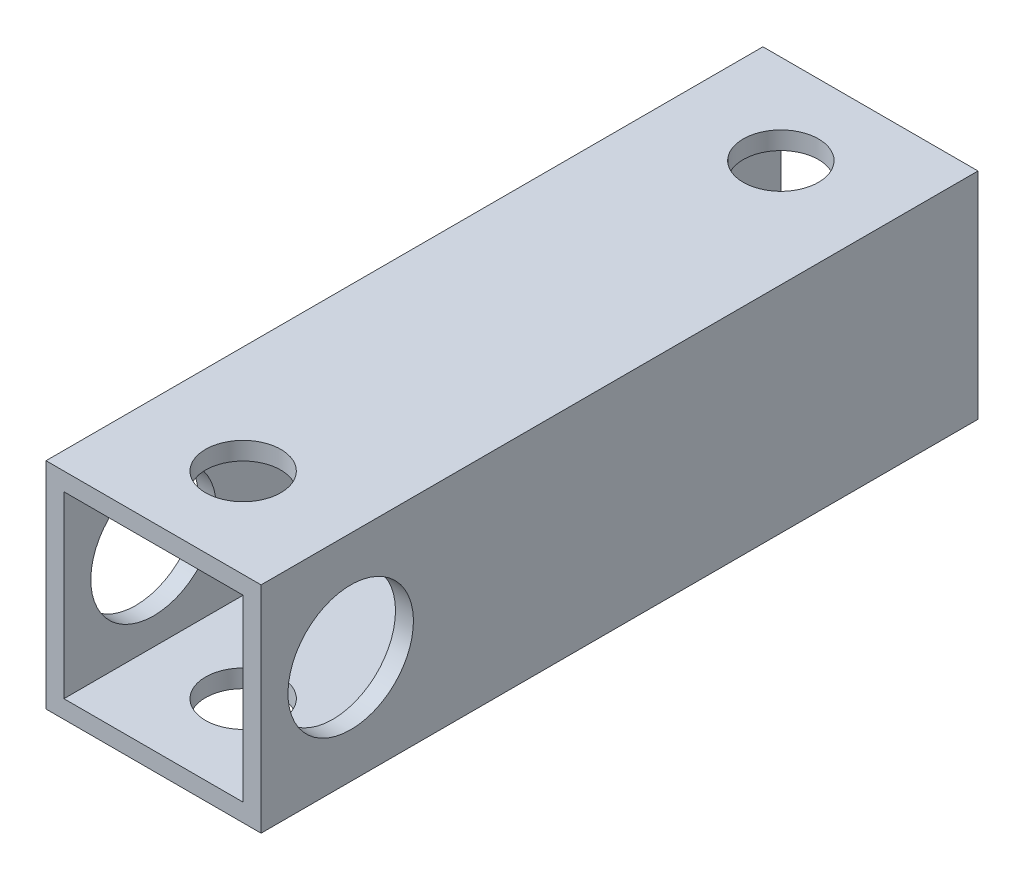
ISO-10303-21;
HEADER;
FILE_DESCRIPTION(('STEP AP214'),'2;1');
FILE_NAME('part.step','',(''),(''),'','','');
FILE_SCHEMA(('AUTOMOTIVE_DESIGN { 1 0 10303 214 1 1 1 1 }'));
ENDSEC;
DATA;
#1=APPLICATION_CONTEXT('core data for automotive mechanical design processes');
#2=APPLICATION_PROTOCOL_DEFINITION('international standard','automotive_design',2000,#1);
#3=PRODUCT_CONTEXT('',#1,'mechanical');
#4=PRODUCT('Part','Part','',(#3));
#5=PRODUCT_RELATED_PRODUCT_CATEGORY('part','',(#4));
#6=PRODUCT_DEFINITION_FORMATION('','',#4);
#7=PRODUCT_DEFINITION_CONTEXT('part definition',#1,'design');
#8=PRODUCT_DEFINITION('design','',#6,#7);
#9=PRODUCT_DEFINITION_SHAPE('','',#8);
#10=(LENGTH_UNIT() NAMED_UNIT(*) SI_UNIT(.MILLI.,.METRE.));
#11=(NAMED_UNIT(*) PLANE_ANGLE_UNIT() SI_UNIT($,.RADIAN.));
#12=(NAMED_UNIT(*) SI_UNIT($,.STERADIAN.) SOLID_ANGLE_UNIT());
#13=UNCERTAINTY_MEASURE_WITH_UNIT(LENGTH_MEASURE(1.E-05),#10,'distance_accuracy_value','');
#14=(GEOMETRIC_REPRESENTATION_CONTEXT(3) GLOBAL_UNCERTAINTY_ASSIGNED_CONTEXT((#13)) GLOBAL_UNIT_ASSIGNED_CONTEXT((#10,
#11,#12)) REPRESENTATION_CONTEXT('',''));
#15=CARTESIAN_POINT('',(0.,0.,0.));
#16=DIRECTION('',(0.,0.,1.));
#17=DIRECTION('',(1.,0.,0.));
#18=AXIS2_PLACEMENT_3D('',#15,#16,#17);
#19=CARTESIAN_POINT('',(6.,6.,40.));
#20=DIRECTION('',(-1.,0.,0.));
#21=DIRECTION('',(0.,-1.,0.));
#22=AXIS2_PLACEMENT_3D('',#19,#20,#21);
#23=PLANE('',#22);
#24=CARTESIAN_POINT('',(6.,0.,35.));
#25=DIRECTION('',(-1.,0.,0.));
#26=DIRECTION('',(0.,-1.,0.));
#27=AXIS2_PLACEMENT_3D('',#24,#25,#26);
#28=CIRCLE('',#27,3.49999999999999);
#29=CARTESIAN_POINT('',(6.,-3.49999999999999,35.));
#30=VERTEX_POINT('',#29);
#31=EDGE_CURVE('E255',#30,#30,#28,.T.);
#32=ORIENTED_EDGE('',*,*,#31,.T.);
#33=EDGE_LOOP('',(#32));
#34=FACE_BOUND('',#33,.T.);
#35=DIRECTION('',(0.,1.,0.));
#36=VECTOR('',#35,1.);
#37=CARTESIAN_POINT('',(6.,6.,0.));
#38=LINE('',#37,#36);
#39=CARTESIAN_POINT('',(6.,-6.,0.));
#40=VERTEX_POINT('',#39);
#41=CARTESIAN_POINT('',(6.,6.,0.));
#42=VERTEX_POINT('',#41);
#43=EDGE_CURVE('E137',#40,#42,#38,.T.);
#44=ORIENTED_EDGE('',*,*,#43,.T.);
#45=DIRECTION('',(0.,0.,-1.));
#46=VECTOR('',#45,1.);
#47=CARTESIAN_POINT('',(6.,6.,40.));
#48=LINE('',#47,#46);
#49=CARTESIAN_POINT('',(6.,6.,40.));
#50=VERTEX_POINT('',#49);
#51=EDGE_CURVE('E179',#50,#42,#48,.T.);
#52=ORIENTED_EDGE('',*,*,#51,.F.);
#53=DIRECTION('',(0.,1.,0.));
#54=VECTOR('',#53,1.);
#55=CARTESIAN_POINT('',(6.,6.,40.));
#56=LINE('',#55,#54);
#57=CARTESIAN_POINT('',(6.,-6.,40.));
#58=VERTEX_POINT('',#57);
#59=EDGE_CURVE('E142',#58,#50,#56,.T.);
#60=ORIENTED_EDGE('',*,*,#59,.F.);
#61=DIRECTION('',(0.,0.,-1.));
#62=VECTOR('',#61,1.);
#63=CARTESIAN_POINT('',(6.,-6.,40.));
#64=LINE('',#63,#62);
#65=EDGE_CURVE('E156',#58,#40,#64,.T.);
#66=ORIENTED_EDGE('',*,*,#65,.T.);
#67=EDGE_LOOP('',(#44,#52,#60,#66));
#68=FACE_BOUND('',#67,.T.);
#69=ADVANCED_FACE('F39',(#34,#68),#23,.F.);
#70=CARTESIAN_POINT('',(-6.,6.,40.));
#71=DIRECTION('',(0.,-1.,0.));
#72=DIRECTION('',(0.,0.,-1.));
#73=AXIS2_PLACEMENT_3D('',#70,#71,#72);
#74=PLANE('',#73);
#75=CARTESIAN_POINT('',(0.,6.,5.));
#76=DIRECTION('',(0.,1.,0.));
#77=DIRECTION('',(0.,0.,1.));
#78=AXIS2_PLACEMENT_3D('',#75,#76,#77);
#79=CIRCLE('',#78,2.1);
#80=CARTESIAN_POINT('',(0.,6.,7.1));
#81=VERTEX_POINT('',#80);
#82=EDGE_CURVE('E195',#81,#81,#79,.T.);
#83=ORIENTED_EDGE('',*,*,#82,.F.);
#84=EDGE_LOOP('',(#83));
#85=FACE_BOUND('',#84,.T.);
#86=CARTESIAN_POINT('',(0.,6.,35.));
#87=DIRECTION('',(0.,1.,0.));
#88=DIRECTION('',(0.,0.,1.));
#89=AXIS2_PLACEMENT_3D('',#86,#87,#88);
#90=CIRCLE('',#89,2.1);
#91=CARTESIAN_POINT('',(0.,6.,37.1));
#92=VERTEX_POINT('',#91);
#93=EDGE_CURVE('E401',#92,#92,#90,.T.);
#94=ORIENTED_EDGE('',*,*,#93,.F.);
#95=EDGE_LOOP('',(#94));
#96=FACE_BOUND('',#95,.T.);
#97=DIRECTION('',(-1.,0.,0.));
#98=VECTOR('',#97,1.);
#99=CARTESIAN_POINT('',(-6.,6.,0.));
#100=LINE('',#99,#98);
#101=CARTESIAN_POINT('',(-6.,6.,0.));
#102=VERTEX_POINT('',#101);
#103=EDGE_CURVE('E160',#42,#102,#100,.T.);
#104=ORIENTED_EDGE('',*,*,#103,.T.);
#105=DIRECTION('',(0.,0.,-1.));
#106=VECTOR('',#105,1.);
#107=CARTESIAN_POINT('',(-6.,6.,40.));
#108=LINE('',#107,#106);
#109=CARTESIAN_POINT('',(-6.,6.,40.));
#110=VERTEX_POINT('',#109);
#111=EDGE_CURVE('E175',#110,#102,#108,.T.);
#112=ORIENTED_EDGE('',*,*,#111,.F.);
#113=DIRECTION('',(-1.,0.,0.));
#114=VECTOR('',#113,1.);
#115=CARTESIAN_POINT('',(-6.,6.,40.));
#116=LINE('',#115,#114);
#117=EDGE_CURVE('E146',#50,#110,#116,.T.);
#118=ORIENTED_EDGE('',*,*,#117,.F.);
#119=ORIENTED_EDGE('',*,*,#51,.T.);
#120=EDGE_LOOP('',(#104,#112,#118,#119));
#121=FACE_BOUND('',#120,.T.);
#122=ADVANCED_FACE('F245',(#85,#96,#121),#74,.F.);
#123=CARTESIAN_POINT('',(-6.,6.,40.));
#124=DIRECTION('',(1.,0.,0.));
#125=DIRECTION('',(0.,1.,0.));
#126=AXIS2_PLACEMENT_3D('',#123,#124,#125);
#127=PLANE('',#126);
#128=CARTESIAN_POINT('',(-6.,0.,35.));
#129=DIRECTION('',(-1.,0.,0.));
#130=DIRECTION('',(0.,-1.,0.));
#131=AXIS2_PLACEMENT_3D('',#128,#129,#130);
#132=CIRCLE('',#131,3.49999999999999);
#133=CARTESIAN_POINT('',(-6.,-3.49999999999999,35.));
#134=VERTEX_POINT('',#133);
#135=EDGE_CURVE('E418',#134,#134,#132,.T.);
#136=ORIENTED_EDGE('',*,*,#135,.F.);
#137=EDGE_LOOP('',(#136));
#138=FACE_BOUND('',#137,.T.);
#139=DIRECTION('',(0.,-1.,0.));
#140=VECTOR('',#139,1.);
#141=CARTESIAN_POINT('',(-6.,6.,0.));
#142=LINE('',#141,#140);
#143=CARTESIAN_POINT('',(-6.,-6.,0.));
#144=VERTEX_POINT('',#143);
#145=EDGE_CURVE('E163',#102,#144,#142,.T.);
#146=ORIENTED_EDGE('',*,*,#145,.T.);
#147=DIRECTION('',(0.,0.,-1.));
#148=VECTOR('',#147,1.);
#149=CARTESIAN_POINT('',(-6.,-6.,40.));
#150=LINE('',#149,#148);
#151=CARTESIAN_POINT('',(-6.,-6.,40.));
#152=VERTEX_POINT('',#151);
#153=EDGE_CURVE('E171',#152,#144,#150,.T.);
#154=ORIENTED_EDGE('',*,*,#153,.F.);
#155=DIRECTION('',(0.,-1.,0.));
#156=VECTOR('',#155,1.);
#157=CARTESIAN_POINT('',(-6.,6.,40.));
#158=LINE('',#157,#156);
#159=EDGE_CURVE('E150',#110,#152,#158,.T.);
#160=ORIENTED_EDGE('',*,*,#159,.F.);
#161=ORIENTED_EDGE('',*,*,#111,.T.);
#162=EDGE_LOOP('',(#146,#154,#160,#161));
#163=FACE_BOUND('',#162,.T.);
#164=ADVANCED_FACE('F250',(#138,#163),#127,.F.);
#165=CARTESIAN_POINT('',(-6.,-6.,40.));
#166=DIRECTION('',(0.,1.,0.));
#167=DIRECTION('',(0.,0.,1.));
#168=AXIS2_PLACEMENT_3D('',#165,#166,#167);
#169=PLANE('',#168);
#170=CARTESIAN_POINT('',(0.,-6.,5.));
#171=DIRECTION('',(0.,1.,0.));
#172=DIRECTION('',(0.,0.,1.));
#173=AXIS2_PLACEMENT_3D('',#170,#171,#172);
#174=CIRCLE('',#173,2.1);
#175=CARTESIAN_POINT('',(0.,-6.,7.1));
#176=VERTEX_POINT('',#175);
#177=EDGE_CURVE('E206',#176,#176,#174,.T.);
#178=ORIENTED_EDGE('',*,*,#177,.T.);
#179=EDGE_LOOP('',(#178));
#180=FACE_BOUND('',#179,.T.);
#181=CARTESIAN_POINT('',(0.,-6.,35.));
#182=DIRECTION('',(0.,1.,0.));
#183=DIRECTION('',(0.,0.,1.));
#184=AXIS2_PLACEMENT_3D('',#181,#182,#183);
#185=CIRCLE('',#184,2.1);
#186=CARTESIAN_POINT('',(0.,-6.,37.1));
#187=VERTEX_POINT('',#186);
#188=EDGE_CURVE('E200',#187,#187,#185,.T.);
#189=ORIENTED_EDGE('',*,*,#188,.T.);
#190=EDGE_LOOP('',(#189));
#191=FACE_BOUND('',#190,.T.);
#192=DIRECTION('',(1.,0.,0.));
#193=VECTOR('',#192,1.);
#194=CARTESIAN_POINT('',(-6.,-6.,0.));
#195=LINE('',#194,#193);
#196=EDGE_CURVE('E147',#144,#40,#195,.T.);
#197=ORIENTED_EDGE('',*,*,#196,.T.);
#198=ORIENTED_EDGE('',*,*,#65,.F.);
#199=DIRECTION('',(1.,0.,0.));
#200=VECTOR('',#199,1.);
#201=CARTESIAN_POINT('',(-6.,-6.,40.));
#202=LINE('',#201,#200);
#203=EDGE_CURVE('E153',#152,#58,#202,.T.);
#204=ORIENTED_EDGE('',*,*,#203,.F.);
#205=ORIENTED_EDGE('',*,*,#153,.T.);
#206=EDGE_LOOP('',(#197,#198,#204,#205));
#207=FACE_BOUND('',#206,.T.);
#208=ADVANCED_FACE('F222',(#180,#191,#207),#169,.F.);
#209=CARTESIAN_POINT('',(0.,0.,40.));
#210=DIRECTION('',(0.,0.,1.));
#211=DIRECTION('',(1.,0.,0.));
#212=AXIS2_PLACEMENT_3D('',#209,#210,#211);
#213=PLANE('',#212);
#214=DIRECTION('',(0.,1.,0.));
#215=VECTOR('',#214,1.);
#216=CARTESIAN_POINT('',(5.,5.,40.));
#217=LINE('',#216,#215);
#218=CARTESIAN_POINT('',(5.,-5.,40.));
#219=VERTEX_POINT('',#218);
#220=CARTESIAN_POINT('',(5.,5.,40.));
#221=VERTEX_POINT('',#220);
#222=EDGE_CURVE('E56',#219,#221,#217,.T.);
#223=ORIENTED_EDGE('',*,*,#222,.F.);
#224=DIRECTION('',(1.,0.,0.));
#225=VECTOR('',#224,1.);
#226=CARTESIAN_POINT('',(-5.,-5.,40.));
#227=LINE('',#226,#225);
#228=CARTESIAN_POINT('',(-5.,-5.,40.));
#229=VERTEX_POINT('',#228);
#230=EDGE_CURVE('E127',#229,#219,#227,.T.);
#231=ORIENTED_EDGE('',*,*,#230,.F.);
#232=DIRECTION('',(0.,-1.,0.));
#233=VECTOR('',#232,1.);
#234=CARTESIAN_POINT('',(-5.,5.,40.));
#235=LINE('',#234,#233);
#236=CARTESIAN_POINT('',(-5.,5.,40.));
#237=VERTEX_POINT('',#236);
#238=EDGE_CURVE('E109',#237,#229,#235,.T.);
#239=ORIENTED_EDGE('',*,*,#238,.F.);
#240=DIRECTION('',(-1.,0.,0.));
#241=VECTOR('',#240,1.);
#242=CARTESIAN_POINT('',(-5.,5.,40.));
#243=LINE('',#242,#241);
#244=EDGE_CURVE('E119',#221,#237,#243,.T.);
#245=ORIENTED_EDGE('',*,*,#244,.F.);
#246=EDGE_LOOP('',(#223,#231,#239,#245));
#247=FACE_BOUND('',#246,.T.);
#248=ORIENTED_EDGE('',*,*,#59,.T.);
#249=ORIENTED_EDGE('',*,*,#117,.T.);
#250=ORIENTED_EDGE('',*,*,#159,.T.);
#251=ORIENTED_EDGE('',*,*,#203,.T.);
#252=EDGE_LOOP('',(#248,#249,#250,#251));
#253=FACE_BOUND('',#252,.T.);
#254=ADVANCED_FACE('F124',(#247,#253),#213,.T.);
#255=CARTESIAN_POINT('',(0.,0.,0.));
#256=DIRECTION('',(0.,0.,1.));
#257=DIRECTION('',(1.,0.,0.));
#258=AXIS2_PLACEMENT_3D('',#255,#256,#257);
#259=PLANE('',#258);
#260=DIRECTION('',(1.,0.,0.));
#261=VECTOR('',#260,1.);
#262=CARTESIAN_POINT('',(0.,-5.,0.));
#263=LINE('',#262,#261);
#264=CARTESIAN_POINT('',(-5.,-5.,0.));
#265=VERTEX_POINT('',#264);
#266=CARTESIAN_POINT('',(5.,-5.,0.));
#267=VERTEX_POINT('',#266);
#268=EDGE_CURVE('E48',#265,#267,#263,.T.);
#269=ORIENTED_EDGE('',*,*,#268,.T.);
#270=DIRECTION('',(0.,1.,0.));
#271=VECTOR('',#270,1.);
#272=CARTESIAN_POINT('',(5.,0.,0.));
#273=LINE('',#272,#271);
#274=CARTESIAN_POINT('',(5.,5.,0.));
#275=VERTEX_POINT('',#274);
#276=EDGE_CURVE('E11',#267,#275,#273,.T.);
#277=ORIENTED_EDGE('',*,*,#276,.T.);
#278=DIRECTION('',(-1.,0.,0.));
#279=VECTOR('',#278,1.);
#280=CARTESIAN_POINT('',(0.,5.,0.));
#281=LINE('',#280,#279);
#282=CARTESIAN_POINT('',(-5.,5.,0.));
#283=VERTEX_POINT('',#282);
#284=EDGE_CURVE('E183',#275,#283,#281,.T.);
#285=ORIENTED_EDGE('',*,*,#284,.T.);
#286=DIRECTION('',(0.,-1.,0.));
#287=VECTOR('',#286,1.);
#288=CARTESIAN_POINT('',(-5.,0.,0.));
#289=LINE('',#288,#287);
#290=EDGE_CURVE('E112',#283,#265,#289,.T.);
#291=ORIENTED_EDGE('',*,*,#290,.T.);
#292=EDGE_LOOP('',(#269,#277,#285,#291));
#293=FACE_BOUND('',#292,.T.);
#294=ORIENTED_EDGE('',*,*,#43,.F.);
#295=ORIENTED_EDGE('',*,*,#196,.F.);
#296=ORIENTED_EDGE('',*,*,#145,.F.);
#297=ORIENTED_EDGE('',*,*,#103,.F.);
#298=EDGE_LOOP('',(#294,#295,#296,#297));
#299=FACE_BOUND('',#298,.T.);
#300=ADVANCED_FACE('F262',(#293,#299),#259,.F.);
#301=CARTESIAN_POINT('',(5.,5.,-7.5));
#302=DIRECTION('',(1.,0.,0.));
#303=DIRECTION('',(0.,0.,-1.));
#304=AXIS2_PLACEMENT_3D('',#301,#302,#303);
#305=PLANE('',#304);
#306=CARTESIAN_POINT('',(5.,0.,35.));
#307=DIRECTION('',(1.,0.,0.));
#308=DIRECTION('',(0.,0.,-1.));
#309=AXIS2_PLACEMENT_3D('',#306,#307,#308);
#310=CIRCLE('',#309,3.49999999999999);
#311=CARTESIAN_POINT('',(5.,0.,31.5));
#312=VERTEX_POINT('',#311);
#313=EDGE_CURVE('E399',#312,#312,#310,.T.);
#314=ORIENTED_EDGE('',*,*,#313,.T.);
#315=EDGE_LOOP('',(#314));
#316=FACE_BOUND('',#315,.T.);
#317=DIRECTION('',(0.,0.,1.));
#318=VECTOR('',#317,1.);
#319=CARTESIAN_POINT('',(5.,-5.,-7.5));
#320=LINE('',#319,#318);
#321=EDGE_CURVE('E134',#267,#219,#320,.T.);
#322=ORIENTED_EDGE('',*,*,#321,.T.);
#323=ORIENTED_EDGE('',*,*,#222,.T.);
#324=DIRECTION('',(0.,0.,1.));
#325=VECTOR('',#324,1.);
#326=CARTESIAN_POINT('',(5.,5.,-7.5));
#327=LINE('',#326,#325);
#328=EDGE_CURVE('E116',#275,#221,#327,.T.);
#329=ORIENTED_EDGE('',*,*,#328,.F.);
#330=ORIENTED_EDGE('',*,*,#276,.F.);
#331=EDGE_LOOP('',(#322,#323,#329,#330));
#332=FACE_BOUND('',#331,.T.);
#333=ADVANCED_FACE('F282',(#316,#332),#305,.F.);
#334=CARTESIAN_POINT('',(-5.,-5.,-7.5));
#335=DIRECTION('',(0.,-1.,0.));
#336=DIRECTION('',(0.,0.,-1.));
#337=AXIS2_PLACEMENT_3D('',#334,#335,#336);
#338=PLANE('',#337);
#339=CARTESIAN_POINT('',(0.,-5.,5.));
#340=DIRECTION('',(0.,-1.,0.));
#341=DIRECTION('',(0.,0.,-1.));
#342=AXIS2_PLACEMENT_3D('',#339,#340,#341);
#343=CIRCLE('',#342,2.1);
#344=CARTESIAN_POINT('',(0.,-5.,2.9));
#345=VERTEX_POINT('',#344);
#346=EDGE_CURVE('E199',#345,#345,#343,.T.);
#347=ORIENTED_EDGE('',*,*,#346,.T.);
#348=EDGE_LOOP('',(#347));
#349=FACE_BOUND('',#348,.T.);
#350=CARTESIAN_POINT('',(0.,-5.,35.));
#351=DIRECTION('',(0.,-1.,0.));
#352=DIRECTION('',(0.,0.,-1.));
#353=AXIS2_PLACEMENT_3D('',#350,#351,#352);
#354=CIRCLE('',#353,2.1);
#355=CARTESIAN_POINT('',(0.,-5.,32.9));
#356=VERTEX_POINT('',#355);
#357=EDGE_CURVE('E194',#356,#356,#354,.T.);
#358=ORIENTED_EDGE('',*,*,#357,.T.);
#359=EDGE_LOOP('',(#358));
#360=FACE_BOUND('',#359,.T.);
#361=DIRECTION('',(0.,0.,1.));
#362=VECTOR('',#361,1.);
#363=CARTESIAN_POINT('',(-5.,-5.,-7.5));
#364=LINE('',#363,#362);
#365=EDGE_CURVE('E115',#265,#229,#364,.T.);
#366=ORIENTED_EDGE('',*,*,#365,.T.);
#367=ORIENTED_EDGE('',*,*,#230,.T.);
#368=ORIENTED_EDGE('',*,*,#321,.F.);
#369=ORIENTED_EDGE('',*,*,#268,.F.);
#370=EDGE_LOOP('',(#366,#367,#368,#369));
#371=FACE_BOUND('',#370,.T.);
#372=ADVANCED_FACE('F288',(#349,#360,#371),#338,.F.);
#373=CARTESIAN_POINT('',(-5.,5.,-7.5));
#374=DIRECTION('',(-1.,0.,0.));
#375=DIRECTION('',(0.,-1.,0.));
#376=AXIS2_PLACEMENT_3D('',#373,#374,#375);
#377=PLANE('',#376);
#378=CARTESIAN_POINT('',(-5.,0.,35.));
#379=DIRECTION('',(-1.,0.,0.));
#380=DIRECTION('',(0.,-1.,0.));
#381=AXIS2_PLACEMENT_3D('',#378,#379,#380);
#382=CIRCLE('',#381,3.49999999999999);
#383=CARTESIAN_POINT('',(-5.,-3.49999999999999,35.));
#384=VERTEX_POINT('',#383);
#385=EDGE_CURVE('E42',#384,#384,#382,.T.);
#386=ORIENTED_EDGE('',*,*,#385,.T.);
#387=EDGE_LOOP('',(#386));
#388=FACE_BOUND('',#387,.T.);
#389=DIRECTION('',(0.,0.,1.));
#390=VECTOR('',#389,1.);
#391=CARTESIAN_POINT('',(-5.,5.,-7.5));
#392=LINE('',#391,#390);
#393=EDGE_CURVE('E64',#283,#237,#392,.T.);
#394=ORIENTED_EDGE('',*,*,#393,.T.);
#395=ORIENTED_EDGE('',*,*,#238,.T.);
#396=ORIENTED_EDGE('',*,*,#365,.F.);
#397=ORIENTED_EDGE('',*,*,#290,.F.);
#398=EDGE_LOOP('',(#394,#395,#396,#397));
#399=FACE_BOUND('',#398,.T.);
#400=ADVANCED_FACE('F106',(#388,#399),#377,.F.);
#401=CARTESIAN_POINT('',(-5.,5.,-7.5));
#402=DIRECTION('',(0.,1.,0.));
#403=DIRECTION('',(0.,0.,1.));
#404=AXIS2_PLACEMENT_3D('',#401,#402,#403);
#405=PLANE('',#404);
#406=CARTESIAN_POINT('',(0.,5.,5.));
#407=DIRECTION('',(0.,1.,0.));
#408=DIRECTION('',(0.,0.,1.));
#409=AXIS2_PLACEMENT_3D('',#406,#407,#408);
#410=CIRCLE('',#409,2.1);
#411=CARTESIAN_POINT('',(0.,5.,7.1));
#412=VERTEX_POINT('',#411);
#413=EDGE_CURVE('E196',#412,#412,#410,.T.);
#414=ORIENTED_EDGE('',*,*,#413,.T.);
#415=EDGE_LOOP('',(#414));
#416=FACE_BOUND('',#415,.T.);
#417=CARTESIAN_POINT('',(0.,5.,35.));
#418=DIRECTION('',(0.,1.,0.));
#419=DIRECTION('',(0.,0.,1.));
#420=AXIS2_PLACEMENT_3D('',#417,#418,#419);
#421=CIRCLE('',#420,2.1);
#422=CARTESIAN_POINT('',(0.,5.,37.1));
#423=VERTEX_POINT('',#422);
#424=EDGE_CURVE('E191',#423,#423,#421,.T.);
#425=ORIENTED_EDGE('',*,*,#424,.T.);
#426=EDGE_LOOP('',(#425));
#427=FACE_BOUND('',#426,.T.);
#428=ORIENTED_EDGE('',*,*,#328,.T.);
#429=ORIENTED_EDGE('',*,*,#244,.T.);
#430=ORIENTED_EDGE('',*,*,#393,.F.);
#431=ORIENTED_EDGE('',*,*,#284,.F.);
#432=EDGE_LOOP('',(#428,#429,#430,#431));
#433=FACE_BOUND('',#432,.T.);
#434=ADVANCED_FACE('F120',(#416,#427,#433),#405,.F.);
#435=CARTESIAN_POINT('',(0.,-41.5,35.));
#436=DIRECTION('',(0.,1.,0.));
#437=DIRECTION('',(0.,0.,1.));
#438=AXIS2_PLACEMENT_3D('',#435,#436,#437);
#439=CYLINDRICAL_SURFACE('',#438,2.1);
#440=ORIENTED_EDGE('',*,*,#93,.T.);
#441=EDGE_LOOP('',(#440));
#442=FACE_BOUND('',#441,.T.);
#443=ORIENTED_EDGE('',*,*,#424,.F.);
#444=EDGE_LOOP('',(#443));
#445=FACE_BOUND('',#444,.T.);
#446=ADVANCED_FACE('F240',(#442,#445),#439,.F.);
#447=CARTESIAN_POINT('',(0.,-41.5,5.));
#448=DIRECTION('',(0.,1.,0.));
#449=DIRECTION('',(0.,0.,1.));
#450=AXIS2_PLACEMENT_3D('',#447,#448,#449);
#451=CYLINDRICAL_SURFACE('',#450,2.1);
#452=ORIENTED_EDGE('',*,*,#82,.T.);
#453=EDGE_LOOP('',(#452));
#454=FACE_BOUND('',#453,.T.);
#455=ORIENTED_EDGE('',*,*,#413,.F.);
#456=EDGE_LOOP('',(#455));
#457=FACE_BOUND('',#456,.T.);
#458=ADVANCED_FACE('F230',(#454,#457),#451,.F.);
#459=ORIENTED_EDGE('',*,*,#357,.F.);
#460=EDGE_LOOP('',(#459));
#461=FACE_BOUND('',#460,.T.);
#462=ORIENTED_EDGE('',*,*,#188,.F.);
#463=EDGE_LOOP('',(#462));
#464=FACE_BOUND('',#463,.T.);
#465=ADVANCED_FACE('F227',(#461,#464),#439,.F.);
#466=ORIENTED_EDGE('',*,*,#346,.F.);
#467=EDGE_LOOP('',(#466));
#468=FACE_BOUND('',#467,.T.);
#469=ORIENTED_EDGE('',*,*,#177,.F.);
#470=EDGE_LOOP('',(#469));
#471=FACE_BOUND('',#470,.T.);
#472=ADVANCED_FACE('F224',(#468,#471),#451,.F.);
#473=CARTESIAN_POINT('',(41.5,0.,35.));
#474=DIRECTION('',(-1.,0.,0.));
#475=DIRECTION('',(0.,-1.,0.));
#476=AXIS2_PLACEMENT_3D('',#473,#474,#475);
#477=CYLINDRICAL_SURFACE('',#476,3.49999999999999);
#478=ORIENTED_EDGE('',*,*,#135,.T.);
#479=EDGE_LOOP('',(#478));
#480=FACE_BOUND('',#479,.T.);
#481=ORIENTED_EDGE('',*,*,#385,.F.);
#482=EDGE_LOOP('',(#481));
#483=FACE_BOUND('',#482,.T.);
#484=ADVANCED_FACE('F226',(#480,#483),#477,.F.);
#485=ORIENTED_EDGE('',*,*,#313,.F.);
#486=EDGE_LOOP('',(#485));
#487=FACE_BOUND('',#486,.T.);
#488=ORIENTED_EDGE('',*,*,#31,.F.);
#489=EDGE_LOOP('',(#488));
#490=FACE_BOUND('',#489,.T.);
#491=ADVANCED_FACE('F235',(#487,#490),#477,.F.);
#492=CLOSED_SHELL('',(#69,#122,#164,#208,#254,#300,#333,#372,#400,#434,#446,#458,#465,#472,#484,#491));
#493=MANIFOLD_SOLID_BREP('B2',#492);
#494=ADVANCED_BREP_SHAPE_REPRESENTATION('',(#18,#493),#14);
#495=SHAPE_DEFINITION_REPRESENTATION(#9,#494);
ENDSEC;
END-ISO-10303-21;
